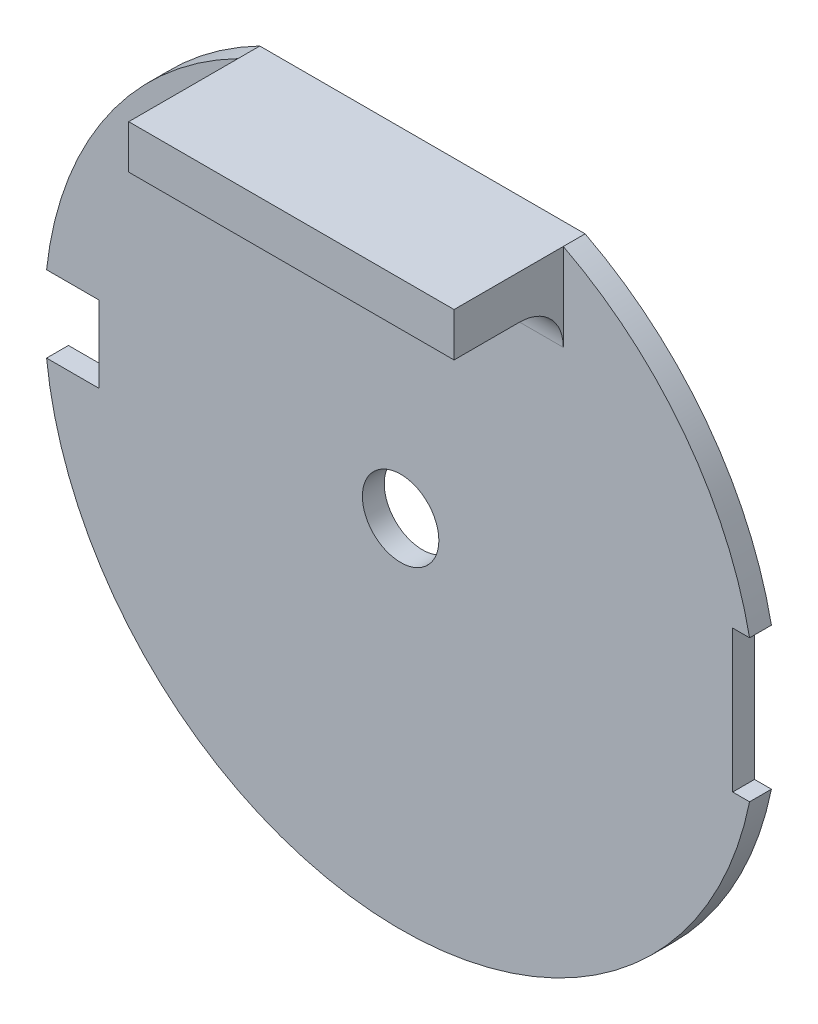
ISO-10303-21;
HEADER;
FILE_DESCRIPTION(('STEP AP214'),'2;1');
FILE_NAME('part.step','',(''),(''),'','','');
FILE_SCHEMA(('AUTOMOTIVE_DESIGN { 1 0 10303 214 1 1 1 1 }'));
ENDSEC;
DATA;
#1=APPLICATION_CONTEXT('core data for automotive mechanical design processes');
#2=APPLICATION_PROTOCOL_DEFINITION('international standard','automotive_design',2000,#1);
#3=PRODUCT_CONTEXT('',#1,'mechanical');
#4=PRODUCT('Part','Part','',(#3));
#5=PRODUCT_RELATED_PRODUCT_CATEGORY('part','',(#4));
#6=PRODUCT_DEFINITION_FORMATION('','',#4);
#7=PRODUCT_DEFINITION_CONTEXT('part definition',#1,'design');
#8=PRODUCT_DEFINITION('design','',#6,#7);
#9=PRODUCT_DEFINITION_SHAPE('','',#8);
#10=(LENGTH_UNIT() NAMED_UNIT(*) SI_UNIT(.MILLI.,.METRE.));
#11=(NAMED_UNIT(*) PLANE_ANGLE_UNIT() SI_UNIT($,.RADIAN.));
#12=(NAMED_UNIT(*) SI_UNIT($,.STERADIAN.) SOLID_ANGLE_UNIT());
#13=UNCERTAINTY_MEASURE_WITH_UNIT(LENGTH_MEASURE(1.E-05),#10,'distance_accuracy_value','');
#14=(GEOMETRIC_REPRESENTATION_CONTEXT(3) GLOBAL_UNCERTAINTY_ASSIGNED_CONTEXT((#13)) GLOBAL_UNIT_ASSIGNED_CONTEXT((#10,
#11,#12)) REPRESENTATION_CONTEXT('',''));
#15=CARTESIAN_POINT('',(0.,0.,0.));
#16=DIRECTION('',(0.,0.,1.));
#17=DIRECTION('',(1.,0.,0.));
#18=AXIS2_PLACEMENT_3D('',#15,#16,#17);
#19=CARTESIAN_POINT('',(0.,0.,1.));
#20=DIRECTION('',(0.,0.,-1.));
#21=DIRECTION('',(-1.,0.,0.));
#22=AXIS2_PLACEMENT_3D('',#19,#20,#21);
#23=CYLINDRICAL_SURFACE('',#22,16.3);
#24=CARTESIAN_POINT('',(0.,0.,0.));
#25=DIRECTION('',(0.,0.,1.));
#26=DIRECTION('',(1.,0.,0.));
#27=AXIS2_PLACEMENT_3D('',#24,#25,#26);
#28=CIRCLE('',#27,16.3);
#29=CARTESIAN_POINT('',(-7.44580418759452,14.5,0.));
#30=VERTEX_POINT('',#29);
#31=CARTESIAN_POINT('',(-16.2057860037704,1.75,0.));
#32=VERTEX_POINT('',#31);
#33=EDGE_CURVE('E245',#30,#32,#28,.T.);
#34=ORIENTED_EDGE('',*,*,#33,.T.);
#35=DIRECTION('',(0.,0.,-1.));
#36=VECTOR('',#35,1.);
#37=CARTESIAN_POINT('',(-16.2057860037704,1.75,1.));
#38=LINE('',#37,#36);
#39=CARTESIAN_POINT('',(-16.2057860037704,1.75,1.));
#40=VERTEX_POINT('',#39);
#41=EDGE_CURVE('E272',#32,#40,#38,.F.);
#42=ORIENTED_EDGE('',*,*,#41,.T.);
#43=CARTESIAN_POINT('',(0.,0.,1.));
#44=DIRECTION('',(0.,0.,1.));
#45=DIRECTION('',(1.,0.,0.));
#46=AXIS2_PLACEMENT_3D('',#43,#44,#45);
#47=CIRCLE('',#46,16.3);
#48=CARTESIAN_POINT('',(-7.44580418759452,14.5,1.));
#49=VERTEX_POINT('',#48);
#50=EDGE_CURVE('E238',#49,#40,#47,.T.);
#51=ORIENTED_EDGE('',*,*,#50,.F.);
#52=DIRECTION('',(0.,0.,-1.));
#53=VECTOR('',#52,1.);
#54=CARTESIAN_POINT('',(-7.44580418759452,14.5,1.));
#55=LINE('',#54,#53);
#56=EDGE_CURVE('E242',#49,#30,#55,.T.);
#57=ORIENTED_EDGE('',*,*,#56,.T.);
#58=EDGE_LOOP('',(#34,#42,#51,#57));
#59=FACE_BOUND('',#58,.T.);
#60=ADVANCED_FACE('F39',(#59),#23,.T.);
#61=CARTESIAN_POINT('',(15.9727111036292,3.25,1.));
#62=VERTEX_POINT('',#61);
#63=CARTESIAN_POINT('',(7.44580418759452,14.5,1.));
#64=VERTEX_POINT('',#63);
#65=EDGE_CURVE('E244',#62,#64,#47,.T.);
#66=ORIENTED_EDGE('',*,*,#65,.F.);
#67=DIRECTION('',(0.,0.,-1.));
#68=VECTOR('',#67,1.);
#69=CARTESIAN_POINT('',(15.9727111036292,3.25,1.));
#70=LINE('',#69,#68);
#71=CARTESIAN_POINT('',(15.9727111036292,3.25,0.));
#72=VERTEX_POINT('',#71);
#73=EDGE_CURVE('E264',#62,#72,#70,.T.);
#74=ORIENTED_EDGE('',*,*,#73,.T.);
#75=CARTESIAN_POINT('',(7.44580418759452,14.5,0.));
#76=VERTEX_POINT('',#75);
#77=EDGE_CURVE('E234',#72,#76,#28,.T.);
#78=ORIENTED_EDGE('',*,*,#77,.T.);
#79=DIRECTION('',(0.,0.,-1.));
#80=VECTOR('',#79,1.);
#81=CARTESIAN_POINT('',(7.44580418759452,14.5,1.));
#82=LINE('',#81,#80);
#83=EDGE_CURVE('E256',#64,#76,#82,.T.);
#84=ORIENTED_EDGE('',*,*,#83,.F.);
#85=EDGE_LOOP('',(#66,#74,#78,#84));
#86=FACE_BOUND('',#85,.T.);
#87=ADVANCED_FACE('F313',(#86),#23,.T.);
#88=CARTESIAN_POINT('',(0.,0.,1.));
#89=DIRECTION('',(0.,0.,1.));
#90=DIRECTION('',(1.,0.,0.));
#91=AXIS2_PLACEMENT_3D('',#88,#89,#90);
#92=PLANE('',#91);
#93=DIRECTION('',(0.,1.,0.));
#94=VECTOR('',#93,1.);
#95=CARTESIAN_POINT('',(7.44580418759452,14.5,1.));
#96=LINE('',#95,#94);
#97=CARTESIAN_POINT('',(7.44580418759452,10.5,1.));
#98=VERTEX_POINT('',#97);
#99=EDGE_CURVE('E55',#98,#64,#96,.T.);
#100=ORIENTED_EDGE('',*,*,#99,.F.);
#101=DIRECTION('',(1.,0.,0.));
#102=VECTOR('',#101,1.);
#103=CARTESIAN_POINT('',(0.,10.5,1.));
#104=LINE('',#103,#102);
#105=CARTESIAN_POINT('',(-7.44580418759452,10.5,1.));
#106=VERTEX_POINT('',#105);
#107=EDGE_CURVE('E279',#98,#106,#104,.F.);
#108=ORIENTED_EDGE('',*,*,#107,.T.);
#109=DIRECTION('',(0.,-1.,0.));
#110=VECTOR('',#109,1.);
#111=CARTESIAN_POINT('',(-7.44580418759452,14.5,1.));
#112=LINE('',#111,#110);
#113=EDGE_CURVE('E62',#49,#106,#112,.T.);
#114=ORIENTED_EDGE('',*,*,#113,.F.);
#115=ORIENTED_EDGE('',*,*,#50,.T.);
#116=DIRECTION('',(-1.,0.,0.));
#117=VECTOR('',#116,1.);
#118=CARTESIAN_POINT('',(-18.8,1.75,1.));
#119=LINE('',#118,#117);
#120=CARTESIAN_POINT('',(-13.8,1.75,1.));
#121=VERTEX_POINT('',#120);
#122=EDGE_CURVE('E181',#121,#40,#119,.T.);
#123=ORIENTED_EDGE('',*,*,#122,.F.);
#124=DIRECTION('',(0.,1.,0.));
#125=VECTOR('',#124,1.);
#126=CARTESIAN_POINT('',(-13.8,1.75,1.));
#127=LINE('',#126,#125);
#128=CARTESIAN_POINT('',(-13.8,-1.75,1.));
#129=VERTEX_POINT('',#128);
#130=EDGE_CURVE('E193',#129,#121,#127,.T.);
#131=ORIENTED_EDGE('',*,*,#130,.F.);
#132=DIRECTION('',(1.,0.,0.));
#133=VECTOR('',#132,1.);
#134=CARTESIAN_POINT('',(-18.8,-1.75,1.));
#135=LINE('',#134,#133);
#136=CARTESIAN_POINT('',(-16.2057860037704,-1.75,1.));
#137=VERTEX_POINT('',#136);
#138=EDGE_CURVE('E190',#137,#129,#135,.T.);
#139=ORIENTED_EDGE('',*,*,#138,.F.);
#140=CARTESIAN_POINT('',(15.9727111036292,-3.25,1.));
#141=VERTEX_POINT('',#140);
#142=EDGE_CURVE('E243',#137,#141,#47,.T.);
#143=ORIENTED_EDGE('',*,*,#142,.T.);
#144=DIRECTION('',(1.,0.,0.));
#145=VECTOR('',#144,1.);
#146=CARTESIAN_POINT('',(15.2,-3.25,1.));
#147=LINE('',#146,#145);
#148=CARTESIAN_POINT('',(15.2,-3.25,1.));
#149=VERTEX_POINT('',#148);
#150=EDGE_CURVE('E170',#149,#141,#147,.T.);
#151=ORIENTED_EDGE('',*,*,#150,.F.);
#152=DIRECTION('',(0.,-1.,0.));
#153=VECTOR('',#152,1.);
#154=CARTESIAN_POINT('',(15.2,3.25,1.));
#155=LINE('',#154,#153);
#156=CARTESIAN_POINT('',(15.2,3.25,1.));
#157=VERTEX_POINT('',#156);
#158=EDGE_CURVE('E165',#157,#149,#155,.T.);
#159=ORIENTED_EDGE('',*,*,#158,.F.);
#160=DIRECTION('',(-1.,0.,0.));
#161=VECTOR('',#160,1.);
#162=CARTESIAN_POINT('',(15.2,3.25,1.));
#163=LINE('',#162,#161);
#164=EDGE_CURVE('E212',#62,#157,#163,.T.);
#165=ORIENTED_EDGE('',*,*,#164,.F.);
#166=ORIENTED_EDGE('',*,*,#65,.T.);
#167=EDGE_LOOP('',(#100,#108,#114,#115,#123,#131,#139,#143,#151,#159,#165,#166));
#168=FACE_BOUND('',#167,.T.);
#169=CARTESIAN_POINT('',(0.,0.,1.));
#170=DIRECTION('',(0.,0.,1.));
#171=DIRECTION('',(1.,0.,0.));
#172=AXIS2_PLACEMENT_3D('',#169,#170,#171);
#173=CIRCLE('',#172,1.75);
#174=CARTESIAN_POINT('',(1.75,0.,1.));
#175=VERTEX_POINT('',#174);
#176=EDGE_CURVE('E230',#175,#175,#173,.T.);
#177=ORIENTED_EDGE('',*,*,#176,.F.);
#178=EDGE_LOOP('',(#177));
#179=FACE_BOUND('',#178,.T.);
#180=ADVANCED_FACE('F288',(#168,#179),#92,.T.);
#181=CARTESIAN_POINT('',(0.,0.,0.));
#182=DIRECTION('',(0.,0.,1.));
#183=DIRECTION('',(1.,0.,0.));
#184=AXIS2_PLACEMENT_3D('',#181,#182,#183);
#185=PLANE('',#184);
#186=DIRECTION('',(0.,1.,0.));
#187=VECTOR('',#186,1.);
#188=CARTESIAN_POINT('',(-13.8,1.75,0.));
#189=LINE('',#188,#187);
#190=CARTESIAN_POINT('',(-13.8,-1.75,0.));
#191=VERTEX_POINT('',#190);
#192=CARTESIAN_POINT('',(-13.8,1.75,0.));
#193=VERTEX_POINT('',#192);
#194=EDGE_CURVE('E180',#191,#193,#189,.T.);
#195=ORIENTED_EDGE('',*,*,#194,.T.);
#196=DIRECTION('',(-1.,0.,0.));
#197=VECTOR('',#196,1.);
#198=CARTESIAN_POINT('',(-18.8,1.75,0.));
#199=LINE('',#198,#197);
#200=EDGE_CURVE('E185',#193,#32,#199,.T.);
#201=ORIENTED_EDGE('',*,*,#200,.T.);
#202=ORIENTED_EDGE('',*,*,#33,.F.);
#203=DIRECTION('',(-1.,0.,0.));
#204=VECTOR('',#203,1.);
#205=CARTESIAN_POINT('',(-7.44580418759452,14.5,0.));
#206=LINE('',#205,#204);
#207=EDGE_CURVE('E249',#76,#30,#206,.T.);
#208=ORIENTED_EDGE('',*,*,#207,.F.);
#209=ORIENTED_EDGE('',*,*,#77,.F.);
#210=DIRECTION('',(-1.,0.,0.));
#211=VECTOR('',#210,1.);
#212=CARTESIAN_POINT('',(15.2,3.25,0.));
#213=LINE('',#212,#211);
#214=CARTESIAN_POINT('',(15.2,3.25,0.));
#215=VERTEX_POINT('',#214);
#216=EDGE_CURVE('E216',#72,#215,#213,.T.);
#217=ORIENTED_EDGE('',*,*,#216,.T.);
#218=DIRECTION('',(0.,-1.,0.));
#219=VECTOR('',#218,1.);
#220=CARTESIAN_POINT('',(15.2,3.25,0.));
#221=LINE('',#220,#219);
#222=CARTESIAN_POINT('',(15.2,-3.25,0.));
#223=VERTEX_POINT('',#222);
#224=EDGE_CURVE('E207',#215,#223,#221,.T.);
#225=ORIENTED_EDGE('',*,*,#224,.T.);
#226=DIRECTION('',(1.,0.,0.));
#227=VECTOR('',#226,1.);
#228=CARTESIAN_POINT('',(15.2,-3.25,0.));
#229=LINE('',#228,#227);
#230=CARTESIAN_POINT('',(15.9727111036292,-3.25,0.));
#231=VERTEX_POINT('',#230);
#232=EDGE_CURVE('E211',#223,#231,#229,.T.);
#233=ORIENTED_EDGE('',*,*,#232,.T.);
#234=CARTESIAN_POINT('',(-16.2057860037704,-1.75,0.));
#235=VERTEX_POINT('',#234);
#236=EDGE_CURVE('E250',#235,#231,#28,.T.);
#237=ORIENTED_EDGE('',*,*,#236,.F.);
#238=DIRECTION('',(1.,0.,0.));
#239=VECTOR('',#238,1.);
#240=CARTESIAN_POINT('',(-18.8,-1.75,0.));
#241=LINE('',#240,#239);
#242=EDGE_CURVE('E176',#235,#191,#241,.T.);
#243=ORIENTED_EDGE('',*,*,#242,.T.);
#244=EDGE_LOOP('',(#195,#201,#202,#208,#209,#217,#225,#233,#237,#243));
#245=FACE_BOUND('',#244,.T.);
#246=CARTESIAN_POINT('',(0.,0.,0.));
#247=DIRECTION('',(0.,0.,1.));
#248=DIRECTION('',(1.,0.,0.));
#249=AXIS2_PLACEMENT_3D('',#246,#247,#248);
#250=CIRCLE('',#249,1.75);
#251=CARTESIAN_POINT('',(1.75,0.,0.));
#252=VERTEX_POINT('',#251);
#253=EDGE_CURVE('E203',#252,#252,#250,.T.);
#254=ORIENTED_EDGE('',*,*,#253,.T.);
#255=EDGE_LOOP('',(#254));
#256=FACE_BOUND('',#255,.T.);
#257=ADVANCED_FACE('F317',(#245,#256),#185,.F.);
#258=ORIENTED_EDGE('',*,*,#142,.F.);
#259=DIRECTION('',(0.,0.,-1.));
#260=VECTOR('',#259,1.);
#261=CARTESIAN_POINT('',(-16.2057860037704,-1.75,1.));
#262=LINE('',#261,#260);
#263=EDGE_CURVE('E268',#137,#235,#262,.T.);
#264=ORIENTED_EDGE('',*,*,#263,.T.);
#265=ORIENTED_EDGE('',*,*,#236,.T.);
#266=DIRECTION('',(0.,0.,-1.));
#267=VECTOR('',#266,1.);
#268=CARTESIAN_POINT('',(15.9727111036292,-3.25,1.));
#269=LINE('',#268,#267);
#270=EDGE_CURVE('E260',#231,#141,#269,.F.);
#271=ORIENTED_EDGE('',*,*,#270,.T.);
#272=EDGE_LOOP('',(#258,#264,#265,#271));
#273=FACE_BOUND('',#272,.T.);
#274=ADVANCED_FACE('F334',(#273),#23,.T.);
#275=CARTESIAN_POINT('',(-7.44580418759452,14.5,1.));
#276=DIRECTION('',(0.,-1.,0.));
#277=DIRECTION('',(0.,0.,-1.));
#278=AXIS2_PLACEMENT_3D('',#275,#276,#277);
#279=PLANE('',#278);
#280=ORIENTED_EDGE('',*,*,#207,.T.);
#281=ORIENTED_EDGE('',*,*,#56,.F.);
#282=DIRECTION('',(0.,0.,-1.));
#283=VECTOR('',#282,1.);
#284=CARTESIAN_POINT('',(-7.44580418759452,14.5,6.));
#285=LINE('',#284,#283);
#286=CARTESIAN_POINT('',(-7.44580418759452,14.5,6.));
#287=VERTEX_POINT('',#286);
#288=EDGE_CURVE('E297',#287,#49,#285,.T.);
#289=ORIENTED_EDGE('',*,*,#288,.F.);
#290=DIRECTION('',(-1.,0.,0.));
#291=VECTOR('',#290,1.);
#292=CARTESIAN_POINT('',(-7.44580418759452,14.5,6.));
#293=LINE('',#292,#291);
#294=CARTESIAN_POINT('',(7.44580418759452,14.5,6.));
#295=VERTEX_POINT('',#294);
#296=EDGE_CURVE('E158',#295,#287,#293,.T.);
#297=ORIENTED_EDGE('',*,*,#296,.F.);
#298=DIRECTION('',(0.,0.,-1.));
#299=VECTOR('',#298,1.);
#300=CARTESIAN_POINT('',(7.44580418759452,14.5,6.));
#301=LINE('',#300,#299);
#302=EDGE_CURVE('E172',#295,#64,#301,.T.);
#303=ORIENTED_EDGE('',*,*,#302,.T.);
#304=ORIENTED_EDGE('',*,*,#83,.T.);
#305=EDGE_LOOP('',(#280,#281,#289,#297,#303,#304));
#306=FACE_BOUND('',#305,.T.);
#307=ADVANCED_FACE('F296',(#306),#279,.F.);
#308=CARTESIAN_POINT('',(0.,0.,1.));
#309=DIRECTION('',(0.,0.,-1.));
#310=DIRECTION('',(-1.,0.,0.));
#311=AXIS2_PLACEMENT_3D('',#308,#309,#310);
#312=CYLINDRICAL_SURFACE('',#311,1.75);
#313=ORIENTED_EDGE('',*,*,#176,.T.);
#314=EDGE_LOOP('',(#313));
#315=FACE_BOUND('',#314,.T.);
#316=ORIENTED_EDGE('',*,*,#253,.F.);
#317=EDGE_LOOP('',(#316));
#318=FACE_BOUND('',#317,.T.);
#319=ADVANCED_FACE('F350',(#315,#318),#312,.F.);
#320=CARTESIAN_POINT('',(15.2,3.25,0.));
#321=DIRECTION('',(0.,1.,0.));
#322=DIRECTION('',(0.,0.,1.));
#323=AXIS2_PLACEMENT_3D('',#320,#321,#322);
#324=PLANE('',#323);
#325=ORIENTED_EDGE('',*,*,#164,.T.);
#326=DIRECTION('',(0.,0.,1.));
#327=VECTOR('',#326,1.);
#328=CARTESIAN_POINT('',(15.2,3.25,0.));
#329=LINE('',#328,#327);
#330=EDGE_CURVE('E194',#215,#157,#329,.T.);
#331=ORIENTED_EDGE('',*,*,#330,.F.);
#332=ORIENTED_EDGE('',*,*,#216,.F.);
#333=ORIENTED_EDGE('',*,*,#73,.F.);
#334=EDGE_LOOP('',(#325,#331,#332,#333));
#335=FACE_BOUND('',#334,.T.);
#336=ADVANCED_FACE('F348',(#335),#324,.F.);
#337=CARTESIAN_POINT('',(15.2,-3.25,0.));
#338=DIRECTION('',(0.,-1.,0.));
#339=DIRECTION('',(0.,0.,-1.));
#340=AXIS2_PLACEMENT_3D('',#337,#338,#339);
#341=PLANE('',#340);
#342=ORIENTED_EDGE('',*,*,#232,.F.);
#343=DIRECTION('',(0.,0.,1.));
#344=VECTOR('',#343,1.);
#345=CARTESIAN_POINT('',(15.2,-3.25,0.));
#346=LINE('',#345,#344);
#347=EDGE_CURVE('E219',#223,#149,#346,.T.);
#348=ORIENTED_EDGE('',*,*,#347,.T.);
#349=ORIENTED_EDGE('',*,*,#150,.T.);
#350=ORIENTED_EDGE('',*,*,#270,.F.);
#351=EDGE_LOOP('',(#342,#348,#349,#350));
#352=FACE_BOUND('',#351,.T.);
#353=ADVANCED_FACE('F343',(#352),#341,.F.);
#354=CARTESIAN_POINT('',(15.2,3.25,0.));
#355=DIRECTION('',(-1.,0.,0.));
#356=DIRECTION('',(0.,0.,1.));
#357=AXIS2_PLACEMENT_3D('',#354,#355,#356);
#358=PLANE('',#357);
#359=ORIENTED_EDGE('',*,*,#158,.T.);
#360=ORIENTED_EDGE('',*,*,#347,.F.);
#361=ORIENTED_EDGE('',*,*,#224,.F.);
#362=ORIENTED_EDGE('',*,*,#330,.T.);
#363=EDGE_LOOP('',(#359,#360,#361,#362));
#364=FACE_BOUND('',#363,.T.);
#365=ADVANCED_FACE('F346',(#364),#358,.F.);
#366=CARTESIAN_POINT('',(-18.8,1.75,0.));
#367=DIRECTION('',(0.,1.,0.));
#368=DIRECTION('',(0.,0.,1.));
#369=AXIS2_PLACEMENT_3D('',#366,#367,#368);
#370=PLANE('',#369);
#371=ORIENTED_EDGE('',*,*,#200,.F.);
#372=DIRECTION('',(0.,0.,1.));
#373=VECTOR('',#372,1.);
#374=CARTESIAN_POINT('',(-13.8,1.75,0.));
#375=LINE('',#374,#373);
#376=EDGE_CURVE('E200',#193,#121,#375,.T.);
#377=ORIENTED_EDGE('',*,*,#376,.T.);
#378=ORIENTED_EDGE('',*,*,#122,.T.);
#379=ORIENTED_EDGE('',*,*,#41,.F.);
#380=EDGE_LOOP('',(#371,#377,#378,#379));
#381=FACE_BOUND('',#380,.T.);
#382=ADVANCED_FACE('F322',(#381),#370,.F.);
#383=CARTESIAN_POINT('',(-18.8,-1.75,0.));
#384=DIRECTION('',(0.,-1.,0.));
#385=DIRECTION('',(0.,0.,-1.));
#386=AXIS2_PLACEMENT_3D('',#383,#384,#385);
#387=PLANE('',#386);
#388=ORIENTED_EDGE('',*,*,#138,.T.);
#389=DIRECTION('',(0.,0.,1.));
#390=VECTOR('',#389,1.);
#391=CARTESIAN_POINT('',(-13.8,-1.75,0.));
#392=LINE('',#391,#390);
#393=EDGE_CURVE('E189',#191,#129,#392,.T.);
#394=ORIENTED_EDGE('',*,*,#393,.F.);
#395=ORIENTED_EDGE('',*,*,#242,.F.);
#396=ORIENTED_EDGE('',*,*,#263,.F.);
#397=EDGE_LOOP('',(#388,#394,#395,#396));
#398=FACE_BOUND('',#397,.T.);
#399=ADVANCED_FACE('F330',(#398),#387,.F.);
#400=CARTESIAN_POINT('',(-13.8,1.75,0.));
#401=DIRECTION('',(1.,0.,0.));
#402=DIRECTION('',(0.,0.,-1.));
#403=AXIS2_PLACEMENT_3D('',#400,#401,#402);
#404=PLANE('',#403);
#405=ORIENTED_EDGE('',*,*,#130,.T.);
#406=ORIENTED_EDGE('',*,*,#376,.F.);
#407=ORIENTED_EDGE('',*,*,#194,.F.);
#408=ORIENTED_EDGE('',*,*,#393,.T.);
#409=EDGE_LOOP('',(#405,#406,#407,#408));
#410=FACE_BOUND('',#409,.T.);
#411=ADVANCED_FACE('F328',(#410),#404,.F.);
#412=CARTESIAN_POINT('',(-7.44580418759452,14.5,6.));
#413=DIRECTION('',(1.,0.,0.));
#414=DIRECTION('',(0.,0.,-1.));
#415=AXIS2_PLACEMENT_3D('',#412,#413,#414);
#416=PLANE('',#415);
#417=ORIENTED_EDGE('',*,*,#113,.T.);
#418=CARTESIAN_POINT('',(-7.44580418759452,10.5,3.));
#419=DIRECTION('',(1.,0.,0.));
#420=DIRECTION('',(0.,0.,-1.));
#421=AXIS2_PLACEMENT_3D('',#418,#419,#420);
#422=CIRCLE('',#421,2.);
#423=CARTESIAN_POINT('',(-7.44580418759452,12.5,3.));
#424=VERTEX_POINT('',#423);
#425=EDGE_CURVE('E11',#106,#424,#422,.T.);
#426=ORIENTED_EDGE('',*,*,#425,.T.);
#427=DIRECTION('',(0.,0.,-1.));
#428=VECTOR('',#427,1.);
#429=CARTESIAN_POINT('',(-7.44580418759452,12.5,6.));
#430=LINE('',#429,#428);
#431=CARTESIAN_POINT('',(-7.44580418759452,12.5,6.));
#432=VERTEX_POINT('',#431);
#433=EDGE_CURVE('E145',#432,#424,#430,.T.);
#434=ORIENTED_EDGE('',*,*,#433,.F.);
#435=DIRECTION('',(0.,-1.,0.));
#436=VECTOR('',#435,1.);
#437=CARTESIAN_POINT('',(-7.44580418759452,14.5,6.));
#438=LINE('',#437,#436);
#439=EDGE_CURVE('E153',#287,#432,#438,.T.);
#440=ORIENTED_EDGE('',*,*,#439,.F.);
#441=ORIENTED_EDGE('',*,*,#288,.T.);
#442=EDGE_LOOP('',(#417,#426,#434,#440,#441));
#443=FACE_BOUND('',#442,.T.);
#444=ADVANCED_FACE('F162',(#443),#416,.F.);
#445=CARTESIAN_POINT('',(-7.44580418759452,12.5,6.));
#446=DIRECTION('',(0.,1.,0.));
#447=DIRECTION('',(0.,0.,1.));
#448=AXIS2_PLACEMENT_3D('',#445,#446,#447);
#449=PLANE('',#448);
#450=ORIENTED_EDGE('',*,*,#433,.T.);
#451=DIRECTION('',(1.,0.,0.));
#452=VECTOR('',#451,1.);
#453=CARTESIAN_POINT('',(-7.44580418759452,12.5,3.));
#454=LINE('',#453,#452);
#455=CARTESIAN_POINT('',(7.44580418759452,12.5,3.));
#456=VERTEX_POINT('',#455);
#457=EDGE_CURVE('E276',#424,#456,#454,.T.);
#458=ORIENTED_EDGE('',*,*,#457,.T.);
#459=DIRECTION('',(0.,0.,-1.));
#460=VECTOR('',#459,1.);
#461=CARTESIAN_POINT('',(7.44580418759452,12.5,6.));
#462=LINE('',#461,#460);
#463=CARTESIAN_POINT('',(7.44580418759452,12.5,6.));
#464=VERTEX_POINT('',#463);
#465=EDGE_CURVE('E148',#464,#456,#462,.T.);
#466=ORIENTED_EDGE('',*,*,#465,.F.);
#467=DIRECTION('',(1.,0.,0.));
#468=VECTOR('',#467,1.);
#469=CARTESIAN_POINT('',(-7.44580418759452,12.5,6.));
#470=LINE('',#469,#468);
#471=EDGE_CURVE('E140',#432,#464,#470,.T.);
#472=ORIENTED_EDGE('',*,*,#471,.F.);
#473=EDGE_LOOP('',(#450,#458,#466,#472));
#474=FACE_BOUND('',#473,.T.);
#475=ADVANCED_FACE('F142',(#474),#449,.F.);
#476=CARTESIAN_POINT('',(7.44580418759452,14.5,6.));
#477=DIRECTION('',(-1.,0.,0.));
#478=DIRECTION('',(0.,0.,1.));
#479=AXIS2_PLACEMENT_3D('',#476,#477,#478);
#480=PLANE('',#479);
#481=ORIENTED_EDGE('',*,*,#99,.T.);
#482=ORIENTED_EDGE('',*,*,#302,.F.);
#483=DIRECTION('',(0.,1.,0.));
#484=VECTOR('',#483,1.);
#485=CARTESIAN_POINT('',(7.44580418759452,14.5,6.));
#486=LINE('',#485,#484);
#487=EDGE_CURVE('E152',#464,#295,#486,.T.);
#488=ORIENTED_EDGE('',*,*,#487,.F.);
#489=ORIENTED_EDGE('',*,*,#465,.T.);
#490=CARTESIAN_POINT('',(7.44580418759452,10.5,3.));
#491=DIRECTION('',(-1.,0.,0.));
#492=DIRECTION('',(0.,0.,1.));
#493=AXIS2_PLACEMENT_3D('',#490,#491,#492);
#494=CIRCLE('',#493,2.);
#495=EDGE_CURVE('E48',#456,#98,#494,.T.);
#496=ORIENTED_EDGE('',*,*,#495,.T.);
#497=EDGE_LOOP('',(#481,#482,#488,#489,#496));
#498=FACE_BOUND('',#497,.T.);
#499=ADVANCED_FACE('F284',(#498),#480,.F.);
#500=CARTESIAN_POINT('',(0.,0.,6.));
#501=DIRECTION('',(0.,0.,1.));
#502=DIRECTION('',(1.,0.,0.));
#503=AXIS2_PLACEMENT_3D('',#500,#501,#502);
#504=PLANE('',#503);
#505=ORIENTED_EDGE('',*,*,#439,.T.);
#506=ORIENTED_EDGE('',*,*,#471,.T.);
#507=ORIENTED_EDGE('',*,*,#487,.T.);
#508=ORIENTED_EDGE('',*,*,#296,.T.);
#509=EDGE_LOOP('',(#505,#506,#507,#508));
#510=FACE_BOUND('',#509,.T.);
#511=ADVANCED_FACE('F156',(#510),#504,.T.);
#512=CARTESIAN_POINT('',(-7.44580418759452,10.5,3.));
#513=DIRECTION('',(1.,0.,0.));
#514=DIRECTION('',(0.,0.,-1.));
#515=AXIS2_PLACEMENT_3D('',#512,#513,#514);
#516=CYLINDRICAL_SURFACE('',#515,2.);
#517=ORIENTED_EDGE('',*,*,#425,.F.);
#518=ORIENTED_EDGE('',*,*,#107,.F.);
#519=ORIENTED_EDGE('',*,*,#495,.F.);
#520=ORIENTED_EDGE('',*,*,#457,.F.);
#521=EDGE_LOOP('',(#517,#518,#519,#520));
#522=FACE_BOUND('',#521,.T.);
#523=ADVANCED_FACE('F41',(#522),#516,.F.);
#524=CLOSED_SHELL('',(#60,#87,#180,#257,#274,#307,#319,#336,#353,#365,#382,#399,#411,#444,#475,
#499,#511,#523));
#525=MANIFOLD_SOLID_BREP('B2',#524);
#526=ADVANCED_BREP_SHAPE_REPRESENTATION('',(#18,#525),#14);
#527=SHAPE_DEFINITION_REPRESENTATION(#9,#526);
ENDSEC;
END-ISO-10303-21;
